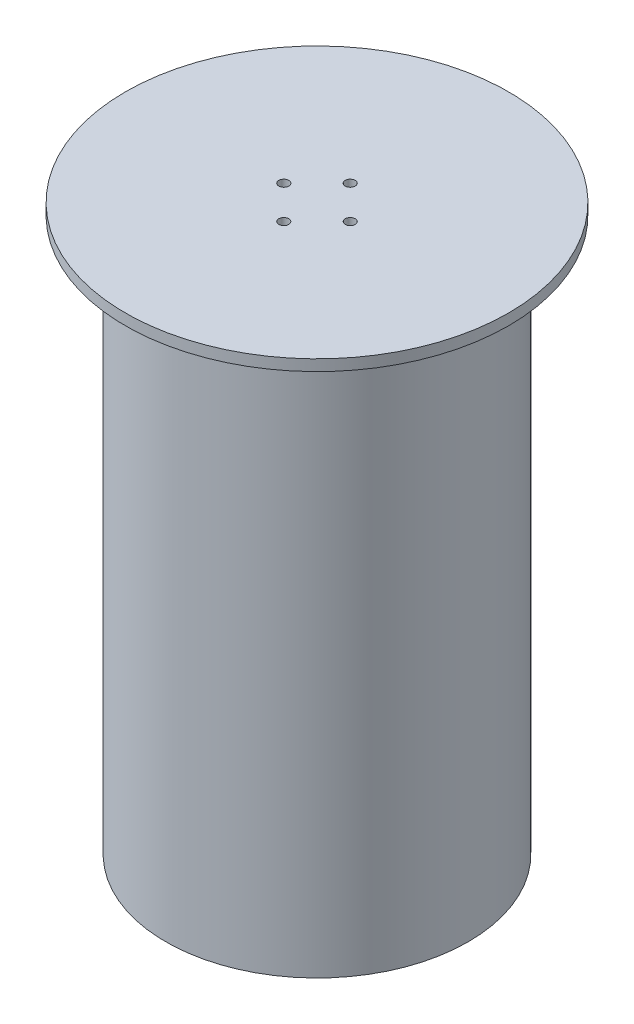
ISO-10303-21;
HEADER;
FILE_DESCRIPTION(('STEP AP214'),'2;1');
FILE_NAME('part.step','',(''),(''),'','','');
FILE_SCHEMA(('AUTOMOTIVE_DESIGN { 1 0 10303 214 1 1 1 1 }'));
ENDSEC;
DATA;
#1=APPLICATION_CONTEXT('core data for automotive mechanical design processes');
#2=APPLICATION_PROTOCOL_DEFINITION('international standard','automotive_design',2000,#1);
#3=PRODUCT_CONTEXT('',#1,'mechanical');
#4=PRODUCT('Part','Part','',(#3));
#5=PRODUCT_RELATED_PRODUCT_CATEGORY('part','',(#4));
#6=PRODUCT_DEFINITION_FORMATION('','',#4);
#7=PRODUCT_DEFINITION_CONTEXT('part definition',#1,'design');
#8=PRODUCT_DEFINITION('design','',#6,#7);
#9=PRODUCT_DEFINITION_SHAPE('','',#8);
#10=(LENGTH_UNIT() NAMED_UNIT(*) SI_UNIT(.MILLI.,.METRE.));
#11=(NAMED_UNIT(*) PLANE_ANGLE_UNIT() SI_UNIT($,.RADIAN.));
#12=(NAMED_UNIT(*) SI_UNIT($,.STERADIAN.) SOLID_ANGLE_UNIT());
#13=UNCERTAINTY_MEASURE_WITH_UNIT(LENGTH_MEASURE(1.E-05),#10,'distance_accuracy_value','');
#14=(GEOMETRIC_REPRESENTATION_CONTEXT(3) GLOBAL_UNCERTAINTY_ASSIGNED_CONTEXT((#13)) GLOBAL_UNIT_ASSIGNED_CONTEXT((#10,
#11,#12)) REPRESENTATION_CONTEXT('',''));
#15=CARTESIAN_POINT('',(0.,0.,0.));
#16=DIRECTION('',(0.,0.,1.));
#17=DIRECTION('',(1.,0.,0.));
#18=AXIS2_PLACEMENT_3D('',#15,#16,#17);
#19=CARTESIAN_POINT('',(131.955,10.,0.));
#20=DIRECTION('',(0.,1.,0.));
#21=DIRECTION('',(-1.,0.,0.));
#22=AXIS2_PLACEMENT_3D('',#19,#20,#21);
#23=PLANE('',#22);
#24=CARTESIAN_POINT('',(0.,10.,0.));
#25=DIRECTION('',(0.,-1.,0.));
#26=DIRECTION('',(1.,0.,0.));
#27=AXIS2_PLACEMENT_3D('',#24,#25,#26);
#28=CIRCLE('',#27,125.955);
#29=CARTESIAN_POINT('',(125.955,9.99999999999999,0.));
#30=VERTEX_POINT('',#29);
#31=EDGE_CURVE('E12',#30,#30,#28,.T.);
#32=ORIENTED_EDGE('',*,*,#31,.T.);
#33=EDGE_LOOP('',(#32));
#34=FACE_BOUND('',#33,.T.);
#35=CARTESIAN_POINT('',(0.,10.,0.));
#36=DIRECTION('',(0.,-1.,0.));
#37=DIRECTION('',(1.,0.,0.));
#38=AXIS2_PLACEMENT_3D('',#35,#36,#37);
#39=CIRCLE('',#38,131.955);
#40=CARTESIAN_POINT('',(131.955,9.99999999999999,0.));
#41=VERTEX_POINT('',#40);
#42=EDGE_CURVE('E72',#41,#41,#39,.T.);
#43=ORIENTED_EDGE('',*,*,#42,.F.);
#44=EDGE_LOOP('',(#43));
#45=FACE_BOUND('',#44,.T.);
#46=ADVANCED_FACE('F44',(#34,#45),#23,.T.);
#47=CARTESIAN_POINT('',(0.,0.,0.));
#48=DIRECTION('',(0.,-1.,0.));
#49=DIRECTION('',(1.,0.,0.));
#50=AXIS2_PLACEMENT_3D('',#47,#48,#49);
#51=CYLINDRICAL_SURFACE('',#50,125.955);
#52=CARTESIAN_POINT('',(0.,0.,0.));
#53=DIRECTION('',(0.,-1.,0.));
#54=DIRECTION('',(1.,0.,0.));
#55=AXIS2_PLACEMENT_3D('',#52,#53,#54);
#56=CIRCLE('',#55,125.955);
#57=CARTESIAN_POINT('',(125.955,0.,0.));
#58=VERTEX_POINT('',#57);
#59=EDGE_CURVE('E50',#58,#58,#56,.T.);
#60=ORIENTED_EDGE('',*,*,#59,.T.);
#61=EDGE_LOOP('',(#60));
#62=FACE_BOUND('',#61,.T.);
#63=ORIENTED_EDGE('',*,*,#31,.F.);
#64=EDGE_LOOP('',(#63));
#65=FACE_BOUND('',#64,.T.);
#66=ADVANCED_FACE('F136',(#62,#65),#51,.F.);
#67=CARTESIAN_POINT('',(125.955,0.,0.));
#68=DIRECTION('',(0.,-1.,0.));
#69=DIRECTION('',(1.,0.,0.));
#70=AXIS2_PLACEMENT_3D('',#67,#68,#69);
#71=PLANE('',#70);
#72=CARTESIAN_POINT('',(0.,0.,0.));
#73=DIRECTION('',(0.,-1.,0.));
#74=DIRECTION('',(1.,0.,0.));
#75=AXIS2_PLACEMENT_3D('',#72,#73,#74);
#76=CIRCLE('',#75,136.525);
#77=CARTESIAN_POINT('',(136.525,0.,0.));
#78=VERTEX_POINT('',#77);
#79=EDGE_CURVE('E54',#78,#78,#76,.T.);
#80=ORIENTED_EDGE('',*,*,#79,.T.);
#81=EDGE_LOOP('',(#80));
#82=FACE_BOUND('',#81,.T.);
#83=ORIENTED_EDGE('',*,*,#59,.F.);
#84=EDGE_LOOP('',(#83));
#85=FACE_BOUND('',#84,.T.);
#86=ADVANCED_FACE('F130',(#82,#85),#71,.T.);
#87=CARTESIAN_POINT('',(0.,0.,0.));
#88=DIRECTION('',(0.,-1.,0.));
#89=DIRECTION('',(1.,0.,0.));
#90=AXIS2_PLACEMENT_3D('',#87,#88,#89);
#91=CYLINDRICAL_SURFACE('',#90,136.525);
#92=CARTESIAN_POINT('',(0.,500.,0.));
#93=DIRECTION('',(0.,-1.,0.));
#94=DIRECTION('',(1.,0.,0.));
#95=AXIS2_PLACEMENT_3D('',#92,#93,#94);
#96=CIRCLE('',#95,136.525);
#97=CARTESIAN_POINT('',(136.525,500.,0.));
#98=VERTEX_POINT('',#97);
#99=EDGE_CURVE('E58',#98,#98,#96,.T.);
#100=ORIENTED_EDGE('',*,*,#99,.T.);
#101=EDGE_LOOP('',(#100));
#102=FACE_BOUND('',#101,.T.);
#103=ORIENTED_EDGE('',*,*,#79,.F.);
#104=EDGE_LOOP('',(#103));
#105=FACE_BOUND('',#104,.T.);
#106=ADVANCED_FACE('F124',(#102,#105),#91,.T.);
#107=CARTESIAN_POINT('',(173.,500.,0.));
#108=DIRECTION('',(0.,-1.,0.));
#109=DIRECTION('',(1.,0.,0.));
#110=AXIS2_PLACEMENT_3D('',#107,#108,#109);
#111=PLANE('',#110);
#112=CARTESIAN_POINT('',(0.,500.,0.));
#113=DIRECTION('',(0.,-1.,0.));
#114=DIRECTION('',(1.,0.,0.));
#115=AXIS2_PLACEMENT_3D('',#112,#113,#114);
#116=CIRCLE('',#115,173.);
#117=CARTESIAN_POINT('',(173.,500.,0.));
#118=VERTEX_POINT('',#117);
#119=EDGE_CURVE('E63',#118,#118,#116,.T.);
#120=ORIENTED_EDGE('',*,*,#119,.T.);
#121=EDGE_LOOP('',(#120));
#122=FACE_BOUND('',#121,.T.);
#123=ORIENTED_EDGE('',*,*,#99,.F.);
#124=EDGE_LOOP('',(#123));
#125=FACE_BOUND('',#124,.T.);
#126=ADVANCED_FACE('F118',(#122,#125),#111,.T.);
#127=CARTESIAN_POINT('',(0.,0.,0.));
#128=DIRECTION('',(0.,-1.,0.));
#129=DIRECTION('',(1.,0.,0.));
#130=AXIS2_PLACEMENT_3D('',#127,#128,#129);
#131=CYLINDRICAL_SURFACE('',#130,173.);
#132=CARTESIAN_POINT('',(0.,510.,0.));
#133=DIRECTION('',(0.,-1.,0.));
#134=DIRECTION('',(1.,0.,0.));
#135=AXIS2_PLACEMENT_3D('',#132,#133,#134);
#136=CIRCLE('',#135,173.);
#137=CARTESIAN_POINT('',(173.,510.,0.));
#138=VERTEX_POINT('',#137);
#139=EDGE_CURVE('E66',#138,#138,#136,.T.);
#140=ORIENTED_EDGE('',*,*,#139,.T.);
#141=EDGE_LOOP('',(#140));
#142=FACE_BOUND('',#141,.T.);
#143=ORIENTED_EDGE('',*,*,#119,.F.);
#144=EDGE_LOOP('',(#143));
#145=FACE_BOUND('',#144,.T.);
#146=ADVANCED_FACE('F106',(#142,#145),#131,.T.);
#147=CARTESIAN_POINT('',(0.,510.,0.));
#148=DIRECTION('',(0.,1.,0.));
#149=DIRECTION('',(-1.,0.,0.));
#150=AXIS2_PLACEMENT_3D('',#147,#148,#149);
#151=PLANE('',#150);
#152=CARTESIAN_POINT('',(-29.9999999999999,510.,0.));
#153=DIRECTION('',(0.,1.,0.));
#154=DIRECTION('',(-1.,0.,0.));
#155=AXIS2_PLACEMENT_3D('',#152,#153,#154);
#156=CIRCLE('',#155,4.50000000000031);
#157=CARTESIAN_POINT('',(-34.5000000000002,510.,0.));
#158=VERTEX_POINT('',#157);
#159=EDGE_CURVE('E91',#158,#158,#156,.T.);
#160=ORIENTED_EDGE('',*,*,#159,.F.);
#161=EDGE_LOOP('',(#160));
#162=FACE_BOUND('',#161,.T.);
#163=CARTESIAN_POINT('',(0.,510.,30.));
#164=DIRECTION('',(0.,1.,0.));
#165=DIRECTION('',(-1.,0.,0.));
#166=AXIS2_PLACEMENT_3D('',#163,#164,#165);
#167=CIRCLE('',#166,4.50000000000021);
#168=CARTESIAN_POINT('',(-4.50000000000014,510.,30.));
#169=VERTEX_POINT('',#168);
#170=EDGE_CURVE('E85',#169,#169,#167,.T.);
#171=ORIENTED_EDGE('',*,*,#170,.F.);
#172=EDGE_LOOP('',(#171));
#173=FACE_BOUND('',#172,.T.);
#174=CARTESIAN_POINT('',(30.0000000000001,510.,0.));
#175=DIRECTION('',(0.,1.,0.));
#176=DIRECTION('',(-1.,0.,0.));
#177=AXIS2_PLACEMENT_3D('',#174,#175,#176);
#178=CIRCLE('',#177,4.5000000000001);
#179=CARTESIAN_POINT('',(25.5,510.,0.));
#180=VERTEX_POINT('',#179);
#181=EDGE_CURVE('E79',#180,#180,#178,.T.);
#182=ORIENTED_EDGE('',*,*,#181,.F.);
#183=EDGE_LOOP('',(#182));
#184=FACE_BOUND('',#183,.T.);
#185=CARTESIAN_POINT('',(0.,510.,-30.));
#186=DIRECTION('',(0.,1.,0.));
#187=DIRECTION('',(-1.,0.,0.));
#188=AXIS2_PLACEMENT_3D('',#185,#186,#187);
#189=CIRCLE('',#188,4.5);
#190=CARTESIAN_POINT('',(-4.49999999999994,510.,-30.));
#191=VERTEX_POINT('',#190);
#192=EDGE_CURVE('E75',#191,#191,#189,.T.);
#193=ORIENTED_EDGE('',*,*,#192,.F.);
#194=EDGE_LOOP('',(#193));
#195=FACE_BOUND('',#194,.T.);
#196=ORIENTED_EDGE('',*,*,#139,.F.);
#197=EDGE_LOOP('',(#196));
#198=FACE_BOUND('',#197,.T.);
#199=ADVANCED_FACE('F102',(#162,#173,#184,#195,#198),#151,.T.);
#200=CARTESIAN_POINT('',(131.955,500.,0.));
#201=DIRECTION('',(0.,-1.,0.));
#202=DIRECTION('',(1.,0.,0.));
#203=AXIS2_PLACEMENT_3D('',#200,#201,#202);
#204=PLANE('',#203);
#205=CARTESIAN_POINT('',(-29.9999999999999,500.,0.));
#206=DIRECTION('',(0.,-1.,0.));
#207=DIRECTION('',(1.,0.,0.));
#208=AXIS2_PLACEMENT_3D('',#205,#206,#207);
#209=CIRCLE('',#208,4.50000000000031);
#210=CARTESIAN_POINT('',(-25.4999999999996,500.,0.));
#211=VERTEX_POINT('',#210);
#212=EDGE_CURVE('E94',#211,#211,#209,.F.);
#213=ORIENTED_EDGE('',*,*,#212,.T.);
#214=EDGE_LOOP('',(#213));
#215=FACE_BOUND('',#214,.T.);
#216=CARTESIAN_POINT('',(0.,500.,30.));
#217=DIRECTION('',(0.,-1.,0.));
#218=DIRECTION('',(1.,0.,0.));
#219=AXIS2_PLACEMENT_3D('',#216,#217,#218);
#220=CIRCLE('',#219,4.50000000000021);
#221=CARTESIAN_POINT('',(4.50000000000027,500.,30.));
#222=VERTEX_POINT('',#221);
#223=EDGE_CURVE('E88',#222,#222,#220,.F.);
#224=ORIENTED_EDGE('',*,*,#223,.T.);
#225=EDGE_LOOP('',(#224));
#226=FACE_BOUND('',#225,.T.);
#227=CARTESIAN_POINT('',(30.0000000000001,500.,0.));
#228=DIRECTION('',(0.,-1.,0.));
#229=DIRECTION('',(1.,0.,0.));
#230=AXIS2_PLACEMENT_3D('',#227,#228,#229);
#231=CIRCLE('',#230,4.5000000000001);
#232=CARTESIAN_POINT('',(34.5000000000002,500.,0.));
#233=VERTEX_POINT('',#232);
#234=EDGE_CURVE('E82',#233,#233,#231,.F.);
#235=ORIENTED_EDGE('',*,*,#234,.T.);
#236=EDGE_LOOP('',(#235));
#237=FACE_BOUND('',#236,.T.);
#238=CARTESIAN_POINT('',(0.,500.,-30.));
#239=DIRECTION('',(0.,-1.,0.));
#240=DIRECTION('',(1.,0.,0.));
#241=AXIS2_PLACEMENT_3D('',#238,#239,#240);
#242=CIRCLE('',#241,4.5);
#243=CARTESIAN_POINT('',(4.50000000000006,500.,-30.));
#244=VERTEX_POINT('',#243);
#245=EDGE_CURVE('E76',#244,#244,#242,.F.);
#246=ORIENTED_EDGE('',*,*,#245,.T.);
#247=EDGE_LOOP('',(#246));
#248=FACE_BOUND('',#247,.T.);
#249=CARTESIAN_POINT('',(0.,500.,0.));
#250=DIRECTION('',(0.,-1.,0.));
#251=DIRECTION('',(1.,0.,0.));
#252=AXIS2_PLACEMENT_3D('',#249,#250,#251);
#253=CIRCLE('',#252,131.955);
#254=CARTESIAN_POINT('',(131.955,500.,0.));
#255=VERTEX_POINT('',#254);
#256=EDGE_CURVE('E69',#255,#255,#253,.T.);
#257=ORIENTED_EDGE('',*,*,#256,.T.);
#258=EDGE_LOOP('',(#257));
#259=FACE_BOUND('',#258,.T.);
#260=ADVANCED_FACE('F105',(#215,#226,#237,#248,#259),#204,.T.);
#261=CARTESIAN_POINT('',(0.,0.,0.));
#262=DIRECTION('',(0.,-1.,0.));
#263=DIRECTION('',(1.,0.,0.));
#264=AXIS2_PLACEMENT_3D('',#261,#262,#263);
#265=CYLINDRICAL_SURFACE('',#264,131.955);
#266=ORIENTED_EDGE('',*,*,#42,.T.);
#267=EDGE_LOOP('',(#266));
#268=FACE_BOUND('',#267,.T.);
#269=ORIENTED_EDGE('',*,*,#256,.F.);
#270=EDGE_LOOP('',(#269));
#271=FACE_BOUND('',#270,.T.);
#272=ADVANCED_FACE('F147',(#268,#271),#265,.F.);
#273=CARTESIAN_POINT('',(0.,-0.00100000000013978,-30.));
#274=DIRECTION('',(0.,1.,0.));
#275=DIRECTION('',(-1.,0.,0.));
#276=AXIS2_PLACEMENT_3D('',#273,#274,#275);
#277=CYLINDRICAL_SURFACE('',#276,4.5);
#278=ORIENTED_EDGE('',*,*,#245,.F.);
#279=EDGE_LOOP('',(#278));
#280=FACE_BOUND('',#279,.T.);
#281=ORIENTED_EDGE('',*,*,#192,.T.);
#282=EDGE_LOOP('',(#281));
#283=FACE_BOUND('',#282,.T.);
#284=ADVANCED_FACE('F150',(#280,#283),#277,.F.);
#285=CARTESIAN_POINT('',(30.,-0.00100000000013978,0.));
#286=DIRECTION('',(0.,1.,0.));
#287=DIRECTION('',(-1.,0.,0.));
#288=AXIS2_PLACEMENT_3D('',#285,#286,#287);
#289=CYLINDRICAL_SURFACE('',#288,4.5000000000001);
#290=ORIENTED_EDGE('',*,*,#234,.F.);
#291=EDGE_LOOP('',(#290));
#292=FACE_BOUND('',#291,.T.);
#293=ORIENTED_EDGE('',*,*,#181,.T.);
#294=EDGE_LOOP('',(#293));
#295=FACE_BOUND('',#294,.T.);
#296=ADVANCED_FACE('F163',(#292,#295),#289,.F.);
#297=CARTESIAN_POINT('',(0.,-0.00100000000013978,30.));
#298=DIRECTION('',(0.,1.,0.));
#299=DIRECTION('',(-1.,0.,0.));
#300=AXIS2_PLACEMENT_3D('',#297,#298,#299);
#301=CYLINDRICAL_SURFACE('',#300,4.50000000000021);
#302=ORIENTED_EDGE('',*,*,#223,.F.);
#303=EDGE_LOOP('',(#302));
#304=FACE_BOUND('',#303,.T.);
#305=ORIENTED_EDGE('',*,*,#170,.T.);
#306=EDGE_LOOP('',(#305));
#307=FACE_BOUND('',#306,.T.);
#308=ADVANCED_FACE('F167',(#304,#307),#301,.F.);
#309=CARTESIAN_POINT('',(-30.,-0.00100000000013978,0.));
#310=DIRECTION('',(0.,1.,0.));
#311=DIRECTION('',(-1.,0.,0.));
#312=AXIS2_PLACEMENT_3D('',#309,#310,#311);
#313=CYLINDRICAL_SURFACE('',#312,4.50000000000031);
#314=ORIENTED_EDGE('',*,*,#212,.F.);
#315=EDGE_LOOP('',(#314));
#316=FACE_BOUND('',#315,.T.);
#317=ORIENTED_EDGE('',*,*,#159,.T.);
#318=EDGE_LOOP('',(#317));
#319=FACE_BOUND('',#318,.T.);
#320=ADVANCED_FACE('F100',(#316,#319),#313,.F.);
#321=CLOSED_SHELL('',(#46,#66,#86,#106,#126,#146,#199,#260,#272,#284,#296,#308,#320));
#322=MANIFOLD_SOLID_BREP('B2',#321);
#323=ADVANCED_BREP_SHAPE_REPRESENTATION('',(#18,#322),#14);
#324=SHAPE_DEFINITION_REPRESENTATION(#9,#323);
ENDSEC;
END-ISO-10303-21;
